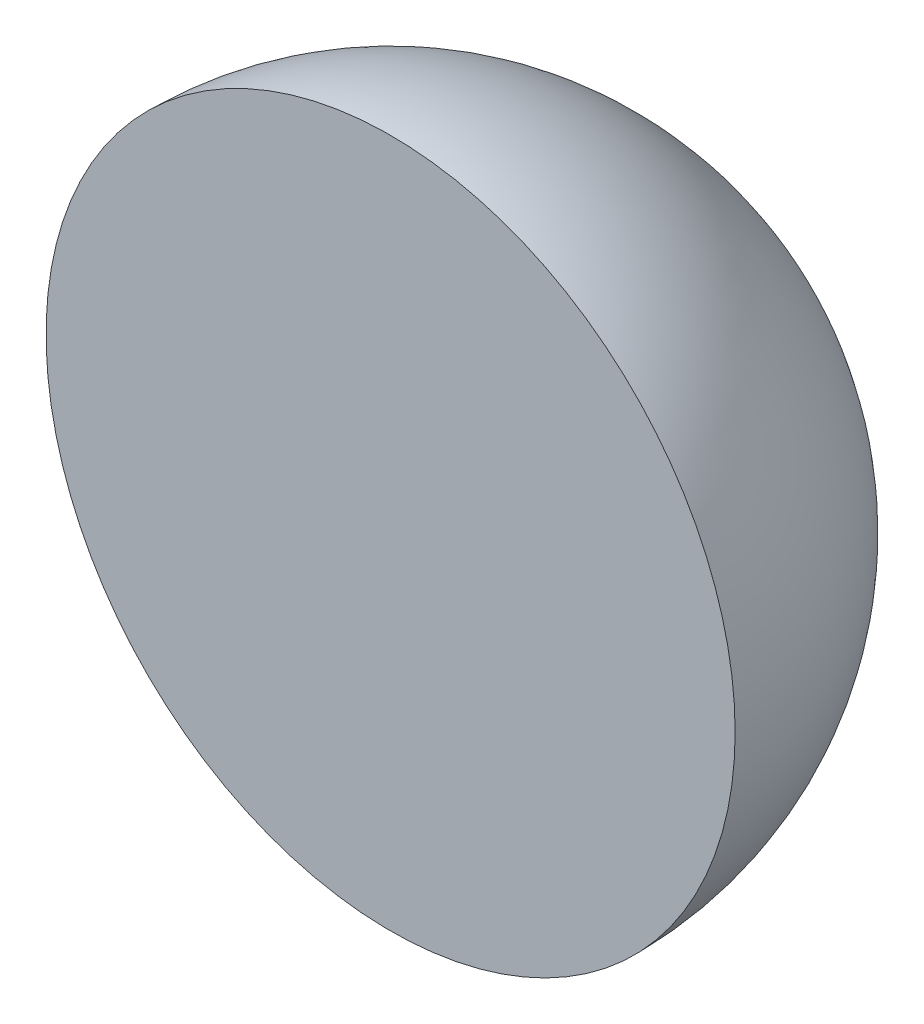
ISO-10303-21;
HEADER;
FILE_DESCRIPTION(('STEP AP214'),'2;1');
FILE_NAME('part.step','',(''),(''),'','','');
FILE_SCHEMA(('AUTOMOTIVE_DESIGN { 1 0 10303 214 1 1 1 1 }'));
ENDSEC;
DATA;
#1=APPLICATION_CONTEXT('core data for automotive mechanical design processes');
#2=APPLICATION_PROTOCOL_DEFINITION('international standard','automotive_design',2000,#1);
#3=PRODUCT_CONTEXT('',#1,'mechanical');
#4=PRODUCT('Part','Part','',(#3));
#5=PRODUCT_RELATED_PRODUCT_CATEGORY('part','',(#4));
#6=PRODUCT_DEFINITION_FORMATION('','',#4);
#7=PRODUCT_DEFINITION_CONTEXT('part definition',#1,'design');
#8=PRODUCT_DEFINITION('design','',#6,#7);
#9=PRODUCT_DEFINITION_SHAPE('','',#8);
#10=(LENGTH_UNIT() NAMED_UNIT(*) SI_UNIT(.MILLI.,.METRE.));
#11=(NAMED_UNIT(*) PLANE_ANGLE_UNIT() SI_UNIT($,.RADIAN.));
#12=(NAMED_UNIT(*) SI_UNIT($,.STERADIAN.) SOLID_ANGLE_UNIT());
#13=UNCERTAINTY_MEASURE_WITH_UNIT(LENGTH_MEASURE(1.E-05),#10,'distance_accuracy_value','');
#14=(GEOMETRIC_REPRESENTATION_CONTEXT(3) GLOBAL_UNCERTAINTY_ASSIGNED_CONTEXT((#13)) GLOBAL_UNIT_ASSIGNED_CONTEXT((#10,
#11,#12)) REPRESENTATION_CONTEXT('',''));
#15=CARTESIAN_POINT('',(0.,0.,0.));
#16=DIRECTION('',(0.,0.,1.));
#17=DIRECTION('',(1.,0.,0.));
#18=AXIS2_PLACEMENT_3D('',#15,#16,#17);
#19=CARTESIAN_POINT('',(0.,3095.,0.));
#20=DIRECTION('',(0.,-1.,0.));
#21=DIRECTION('',(1.,0.,0.));
#22=AXIS2_PLACEMENT_3D('',#19,#20,#21);
#23=SPHERICAL_SURFACE('',#22,3095.);
#24=CARTESIAN_POINT('',(0.,3095.,0.));
#25=DIRECTION('',(0.,0.,-1.));
#26=DIRECTION('',(1.,0.,0.));
#27=AXIS2_PLACEMENT_3D('',#24,#25,#26);
#28=SPHERICAL_SURFACE('',#27,3095.);
#29=CARTESIAN_POINT('',(0.,3095.,0.));
#30=DIRECTION('',(0.,0.,-1.));
#31=DIRECTION('',(1.,0.,0.));
#32=AXIS2_PLACEMENT_3D('',#29,#30,#31);
#33=CIRCLE('',#32,3095.);
#34=CARTESIAN_POINT('',(3095.,3095.,-2.1612269487439E-11));
#35=VERTEX_POINT('',#34);
#36=EDGE_CURVE('E10',#35,#35,#33,.T.);
#37=ORIENTED_EDGE('',*,*,#36,.T.);
#38=EDGE_LOOP('',(#37));
#39=FACE_BOUND('',#38,.T.);
#40=ADVANCED_FACE('F32',(#39),#28,.T.);
#41=CARTESIAN_POINT('',(0.,3095.,0.));
#42=DIRECTION('',(0.,0.,1.));
#43=DIRECTION('',(1.,0.,0.));
#44=AXIS2_PLACEMENT_3D('',#41,#42,#43);
#45=PLANE('',#44);
#46=ORIENTED_EDGE('',*,*,#36,.F.);
#47=EDGE_LOOP('',(#46));
#48=FACE_BOUND('',#47,.T.);
#49=ADVANCED_FACE('F40',(#48),#45,.T.);
#50=CLOSED_SHELL('',(#40,#49));
#51=MANIFOLD_SOLID_BREP('B2',#50);
#52=ADVANCED_BREP_SHAPE_REPRESENTATION('',(#18,#51),#14);
#53=SHAPE_DEFINITION_REPRESENTATION(#9,#52);
ENDSEC;
END-ISO-10303-21;
